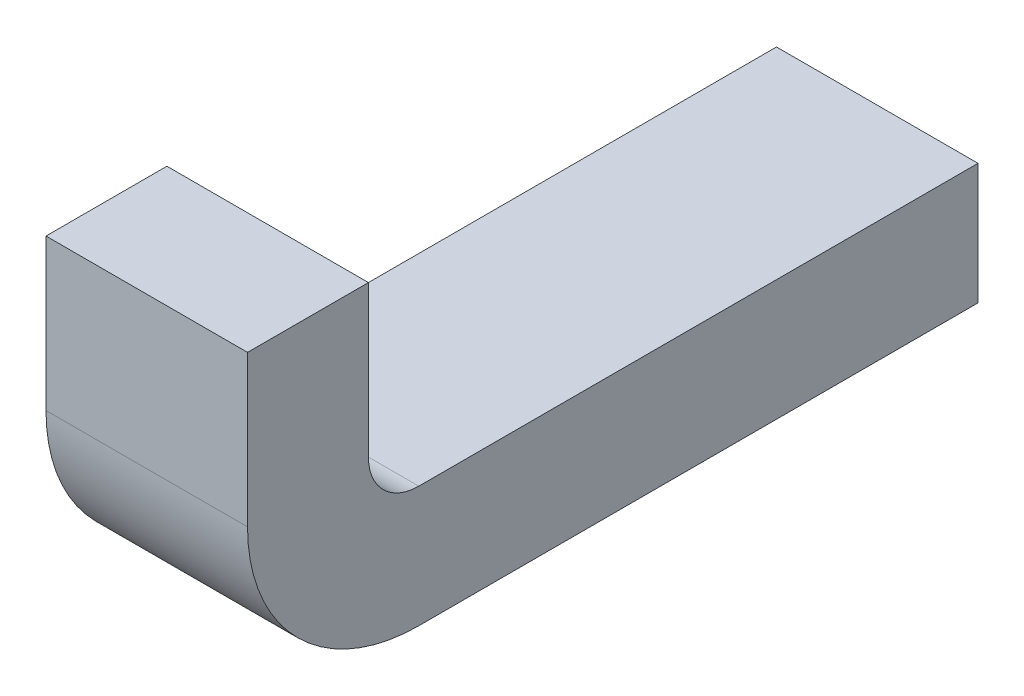
ISO-10303-21;
HEADER;
FILE_DESCRIPTION(('STEP AP214'),'2;1');
FILE_NAME('part.step','',(''),(''),'','','');
FILE_SCHEMA(('AUTOMOTIVE_DESIGN { 1 0 10303 214 1 1 1 1 }'));
ENDSEC;
DATA;
#1=APPLICATION_CONTEXT('core data for automotive mechanical design processes');
#2=APPLICATION_PROTOCOL_DEFINITION('international standard','automotive_design',2000,#1);
#3=PRODUCT_CONTEXT('',#1,'mechanical');
#4=PRODUCT('Part','Part','',(#3));
#5=PRODUCT_RELATED_PRODUCT_CATEGORY('part','',(#4));
#6=PRODUCT_DEFINITION_FORMATION('','',#4);
#7=PRODUCT_DEFINITION_CONTEXT('part definition',#1,'design');
#8=PRODUCT_DEFINITION('design','',#6,#7);
#9=PRODUCT_DEFINITION_SHAPE('','',#8);
#10=(LENGTH_UNIT() NAMED_UNIT(*) SI_UNIT(.MILLI.,.METRE.));
#11=(NAMED_UNIT(*) PLANE_ANGLE_UNIT() SI_UNIT($,.RADIAN.));
#12=(NAMED_UNIT(*) SI_UNIT($,.STERADIAN.) SOLID_ANGLE_UNIT());
#13=UNCERTAINTY_MEASURE_WITH_UNIT(LENGTH_MEASURE(1.E-05),#10,'distance_accuracy_value','');
#14=(GEOMETRIC_REPRESENTATION_CONTEXT(3) GLOBAL_UNCERTAINTY_ASSIGNED_CONTEXT((#13)) GLOBAL_UNIT_ASSIGNED_CONTEXT((#10,
#11,#12)) REPRESENTATION_CONTEXT('',''));
#15=CARTESIAN_POINT('',(0.,0.,0.));
#16=DIRECTION('',(0.,0.,1.));
#17=DIRECTION('',(1.,0.,0.));
#18=AXIS2_PLACEMENT_3D('',#15,#16,#17);
#19=CARTESIAN_POINT('',(2.15,0.32,-3.130000000002));
#20=DIRECTION('',(0.,0.,1.));
#21=DIRECTION('',(1.,0.,0.));
#22=AXIS2_PLACEMENT_3D('',#19,#20,#21);
#23=PLANE('',#22);
#24=DIRECTION('',(0.,1.,0.));
#25=VECTOR('',#24,1.);
#26=CARTESIAN_POINT('',(2.175,0.17,-3.130000000002));
#27=LINE('',#26,#25);
#28=CARTESIAN_POINT('',(2.175,0.17,-3.130000000002));
#29=VERTEX_POINT('',#28);
#30=CARTESIAN_POINT('',(2.175,0.319999999999995,-3.130000000002));
#31=VERTEX_POINT('',#30);
#32=EDGE_CURVE('E123',#29,#31,#27,.T.);
#33=ORIENTED_EDGE('',*,*,#32,.F.);
#34=DIRECTION('',(1.,0.,0.));
#35=VECTOR('',#34,1.);
#36=CARTESIAN_POINT('',(2.15,0.17,-3.130000000002));
#37=LINE('',#36,#35);
#38=CARTESIAN_POINT('',(2.375,0.17,-3.130000000002));
#39=VERTEX_POINT('',#38);
#40=EDGE_CURVE('E64',#39,#29,#37,.F.);
#41=ORIENTED_EDGE('',*,*,#40,.F.);
#42=DIRECTION('',(0.,1.,0.));
#43=VECTOR('',#42,1.);
#44=CARTESIAN_POINT('',(2.375,0.32,-3.130000000002));
#45=LINE('',#44,#43);
#46=CARTESIAN_POINT('',(2.375,0.319999999999995,-3.130000000002));
#47=VERTEX_POINT('',#46);
#48=EDGE_CURVE('E70',#39,#47,#45,.T.);
#49=ORIENTED_EDGE('',*,*,#48,.T.);
#50=DIRECTION('',(1.,0.,0.));
#51=VECTOR('',#50,1.);
#52=CARTESIAN_POINT('',(2.15,0.319999999999985,-3.130000000002));
#53=LINE('',#52,#51);
#54=EDGE_CURVE('E160',#31,#47,#53,.T.);
#55=ORIENTED_EDGE('',*,*,#54,.F.);
#56=EDGE_LOOP('',(#33,#41,#49,#55));
#57=FACE_BOUND('',#56,.T.);
#58=ADVANCED_FACE('F16',(#57),#23,.T.);
#59=CARTESIAN_POINT('',(2.15,0.32,-3.250000000002));
#60=DIRECTION('',(0.,1.,1.246832498358E-13));
#61=DIRECTION('',(0.,-1.246832498358E-13,1.));
#62=AXIS2_PLACEMENT_3D('',#59,#60,#61);
#63=PLANE('',#62);
#64=DIRECTION('',(0.,0.,1.));
#65=VECTOR('',#64,1.);
#66=CARTESIAN_POINT('',(2.175,0.32,-3.300000000002));
#67=LINE('',#66,#65);
#68=CARTESIAN_POINT('',(2.175,0.32,-3.250000000002));
#69=VERTEX_POINT('',#68);
#70=EDGE_CURVE('E101',#31,#69,#67,.F.);
#71=ORIENTED_EDGE('',*,*,#70,.F.);
#72=ORIENTED_EDGE('',*,*,#54,.T.);
#73=DIRECTION('',(0.,0.,1.));
#74=VECTOR('',#73,1.);
#75=CARTESIAN_POINT('',(2.375,0.32,3.855));
#76=LINE('',#75,#74);
#77=CARTESIAN_POINT('',(2.375,0.32,-3.250000000002));
#78=VERTEX_POINT('',#77);
#79=EDGE_CURVE('E148',#47,#78,#76,.F.);
#80=ORIENTED_EDGE('',*,*,#79,.T.);
#81=DIRECTION('',(-1.,0.,0.));
#82=VECTOR('',#81,1.);
#83=CARTESIAN_POINT('',(2.15,0.32,-3.250000000002));
#84=LINE('',#83,#82);
#85=EDGE_CURVE('E155',#69,#78,#84,.F.);
#86=ORIENTED_EDGE('',*,*,#85,.F.);
#87=EDGE_LOOP('',(#71,#72,#80,#86));
#88=FACE_BOUND('',#87,.T.);
#89=ADVANCED_FACE('F179',(#88),#63,.T.);
#90=CARTESIAN_POINT('',(2.15,0.,-3.300000000002));
#91=DIRECTION('',(0.,-1.,0.));
#92=DIRECTION('',(0.,0.,-1.));
#93=AXIS2_PLACEMENT_3D('',#90,#91,#92);
#94=PLANE('',#93);
#95=DIRECTION('',(0.,0.,1.));
#96=VECTOR('',#95,1.);
#97=CARTESIAN_POINT('',(2.175,0.,-3.300000000002));
#98=LINE('',#97,#96);
#99=CARTESIAN_POINT('',(2.175,0.,-3.854999999999));
#100=VERTEX_POINT('',#99);
#101=CARTESIAN_POINT('',(2.175,0.,-3.300000000002));
#102=VERTEX_POINT('',#101);
#103=EDGE_CURVE('E112',#100,#102,#98,.T.);
#104=ORIENTED_EDGE('',*,*,#103,.F.);
#105=DIRECTION('',(-1.,0.,0.));
#106=VECTOR('',#105,1.);
#107=CARTESIAN_POINT('',(2.15,0.,-3.854999999999));
#108=LINE('',#107,#106);
#109=CARTESIAN_POINT('',(2.375,0.,-3.854999999999));
#110=VERTEX_POINT('',#109);
#111=EDGE_CURVE('E125',#110,#100,#108,.T.);
#112=ORIENTED_EDGE('',*,*,#111,.F.);
#113=DIRECTION('',(0.,0.,1.));
#114=VECTOR('',#113,1.);
#115=CARTESIAN_POINT('',(2.375,0.,3.855));
#116=LINE('',#115,#114);
#117=CARTESIAN_POINT('',(2.375,0.,-3.300000000002));
#118=VERTEX_POINT('',#117);
#119=EDGE_CURVE('E57',#110,#118,#116,.T.);
#120=ORIENTED_EDGE('',*,*,#119,.T.);
#121=DIRECTION('',(1.,0.,0.));
#122=VECTOR('',#121,1.);
#123=CARTESIAN_POINT('',(2.15,0.,-3.300000000002));
#124=LINE('',#123,#122);
#125=EDGE_CURVE('E159',#102,#118,#124,.T.);
#126=ORIENTED_EDGE('',*,*,#125,.F.);
#127=EDGE_LOOP('',(#104,#112,#120,#126));
#128=FACE_BOUND('',#127,.T.);
#129=ADVANCED_FACE('F189',(#128),#94,.T.);
#130=CARTESIAN_POINT('',(2.15,0.17,-3.300000000002));
#131=DIRECTION('',(1.,0.,0.));
#132=DIRECTION('',(0.,0.,-1.));
#133=AXIS2_PLACEMENT_3D('',#130,#131,#132);
#134=CYLINDRICAL_SURFACE('',#133,0.17);
#135=CARTESIAN_POINT('',(2.175,0.17,-3.300000000002));
#136=DIRECTION('',(1.,0.,0.));
#137=DIRECTION('',(0.,0.,-1.));
#138=AXIS2_PLACEMENT_3D('',#135,#136,#137);
#139=CIRCLE('',#138,0.17);
#140=EDGE_CURVE('E95',#102,#29,#139,.F.);
#141=ORIENTED_EDGE('',*,*,#140,.F.);
#142=ORIENTED_EDGE('',*,*,#125,.T.);
#143=CARTESIAN_POINT('',(2.375,0.17,-3.300000000002));
#144=DIRECTION('',(1.,0.,0.));
#145=DIRECTION('',(0.,0.,-1.));
#146=AXIS2_PLACEMENT_3D('',#143,#144,#145);
#147=CIRCLE('',#146,0.17);
#148=EDGE_CURVE('E19',#118,#39,#147,.F.);
#149=ORIENTED_EDGE('',*,*,#148,.T.);
#150=ORIENTED_EDGE('',*,*,#40,.T.);
#151=EDGE_LOOP('',(#141,#142,#149,#150));
#152=FACE_BOUND('',#151,.T.);
#153=ADVANCED_FACE('F192',(#152),#134,.T.);
#154=CARTESIAN_POINT('',(2.15,0.17,-3.250000000002));
#155=DIRECTION('',(0.,0.,-1.));
#156=DIRECTION('',(-1.,0.,0.));
#157=AXIS2_PLACEMENT_3D('',#154,#155,#156);
#158=PLANE('',#157);
#159=DIRECTION('',(0.,1.,0.));
#160=VECTOR('',#159,1.);
#161=CARTESIAN_POINT('',(2.175,0.17,-3.250000000002));
#162=LINE('',#161,#160);
#163=CARTESIAN_POINT('',(2.175,0.17,-3.250000000002));
#164=VERTEX_POINT('',#163);
#165=EDGE_CURVE('E91',#69,#164,#162,.F.);
#166=ORIENTED_EDGE('',*,*,#165,.F.);
#167=ORIENTED_EDGE('',*,*,#85,.T.);
#168=DIRECTION('',(0.,1.,0.));
#169=VECTOR('',#168,1.);
#170=CARTESIAN_POINT('',(2.375,0.32,-3.250000000002));
#171=LINE('',#170,#169);
#172=CARTESIAN_POINT('',(2.375,0.17,-3.250000000002));
#173=VERTEX_POINT('',#172);
#174=EDGE_CURVE('E85',#78,#173,#171,.F.);
#175=ORIENTED_EDGE('',*,*,#174,.T.);
#176=DIRECTION('',(1.,0.,0.));
#177=VECTOR('',#176,1.);
#178=CARTESIAN_POINT('',(2.15,0.17,-3.250000000002));
#179=LINE('',#178,#177);
#180=EDGE_CURVE('E89',#173,#164,#179,.F.);
#181=ORIENTED_EDGE('',*,*,#180,.T.);
#182=EDGE_LOOP('',(#166,#167,#175,#181));
#183=FACE_BOUND('',#182,.T.);
#184=ADVANCED_FACE('F90',(#183),#158,.T.);
#185=CARTESIAN_POINT('',(2.375,0.32,3.855));
#186=DIRECTION('',(-1.,0.,0.));
#187=DIRECTION('',(0.,0.,1.));
#188=AXIS2_PLACEMENT_3D('',#185,#186,#187);
#189=PLANE('',#188);
#190=ORIENTED_EDGE('',*,*,#79,.F.);
#191=ORIENTED_EDGE('',*,*,#48,.F.);
#192=ORIENTED_EDGE('',*,*,#148,.F.);
#193=ORIENTED_EDGE('',*,*,#119,.F.);
#194=DIRECTION('',(0.,1.,0.));
#195=VECTOR('',#194,1.);
#196=CARTESIAN_POINT('',(2.375,0.,-3.854999999999));
#197=LINE('',#196,#195);
#198=CARTESIAN_POINT('',(2.375,0.12,-3.854999999999));
#199=VERTEX_POINT('',#198);
#200=EDGE_CURVE('E138',#199,#110,#197,.F.);
#201=ORIENTED_EDGE('',*,*,#200,.F.);
#202=DIRECTION('',(0.,0.,1.));
#203=VECTOR('',#202,1.);
#204=CARTESIAN_POINT('',(2.375,0.12,-3.854999999999));
#205=LINE('',#204,#203);
#206=CARTESIAN_POINT('',(2.375,0.12,-3.300000000002));
#207=VERTEX_POINT('',#206);
#208=EDGE_CURVE('E108',#207,#199,#205,.F.);
#209=ORIENTED_EDGE('',*,*,#208,.F.);
#210=CARTESIAN_POINT('',(2.375,0.17,-3.300000000002));
#211=DIRECTION('',(1.,0.,0.));
#212=DIRECTION('',(0.,0.,-1.));
#213=AXIS2_PLACEMENT_3D('',#210,#211,#212);
#214=CIRCLE('',#213,0.05);
#215=EDGE_CURVE('E106',#207,#173,#214,.F.);
#216=ORIENTED_EDGE('',*,*,#215,.T.);
#217=ORIENTED_EDGE('',*,*,#174,.F.);
#218=EDGE_LOOP('',(#190,#191,#192,#193,#201,#209,#216,#217));
#219=FACE_BOUND('',#218,.T.);
#220=ADVANCED_FACE('F181',(#219),#189,.F.);
#221=CARTESIAN_POINT('',(2.15,0.,-3.854999999999));
#222=DIRECTION('',(0.,0.,-1.));
#223=DIRECTION('',(-1.,0.,0.));
#224=AXIS2_PLACEMENT_3D('',#221,#222,#223);
#225=PLANE('',#224);
#226=DIRECTION('',(0.,1.,0.));
#227=VECTOR('',#226,1.);
#228=CARTESIAN_POINT('',(2.175,0.17,-3.854999999999));
#229=LINE('',#228,#227);
#230=CARTESIAN_POINT('',(2.175,0.12,-3.854999999999));
#231=VERTEX_POINT('',#230);
#232=EDGE_CURVE('E102',#231,#100,#229,.F.);
#233=ORIENTED_EDGE('',*,*,#232,.F.);
#234=DIRECTION('',(1.,0.,0.));
#235=VECTOR('',#234,1.);
#236=CARTESIAN_POINT('',(2.15,0.12,-3.854999999999));
#237=LINE('',#236,#235);
#238=EDGE_CURVE('E129',#199,#231,#237,.F.);
#239=ORIENTED_EDGE('',*,*,#238,.F.);
#240=ORIENTED_EDGE('',*,*,#200,.T.);
#241=ORIENTED_EDGE('',*,*,#111,.T.);
#242=EDGE_LOOP('',(#233,#239,#240,#241));
#243=FACE_BOUND('',#242,.T.);
#244=ADVANCED_FACE('F188',(#243),#225,.T.);
#245=CARTESIAN_POINT('',(2.175,0.17,-3.300000000002));
#246=DIRECTION('',(-1.,0.,0.));
#247=DIRECTION('',(0.,0.,1.));
#248=AXIS2_PLACEMENT_3D('',#245,#246,#247);
#249=PLANE('',#248);
#250=ORIENTED_EDGE('',*,*,#103,.T.);
#251=ORIENTED_EDGE('',*,*,#140,.T.);
#252=ORIENTED_EDGE('',*,*,#32,.T.);
#253=ORIENTED_EDGE('',*,*,#70,.T.);
#254=ORIENTED_EDGE('',*,*,#165,.T.);
#255=CARTESIAN_POINT('',(2.175,0.17,-3.300000000002));
#256=DIRECTION('',(1.,0.,0.));
#257=DIRECTION('',(0.,0.,-1.));
#258=AXIS2_PLACEMENT_3D('',#255,#256,#257);
#259=CIRCLE('',#258,0.05);
#260=CARTESIAN_POINT('',(2.175,0.12,-3.300000000002));
#261=VERTEX_POINT('',#260);
#262=EDGE_CURVE('E34',#164,#261,#259,.T.);
#263=ORIENTED_EDGE('',*,*,#262,.T.);
#264=DIRECTION('',(0.,0.,1.));
#265=VECTOR('',#264,1.);
#266=CARTESIAN_POINT('',(2.175,0.12,-3.854999999999));
#267=LINE('',#266,#265);
#268=EDGE_CURVE('E25',#231,#261,#267,.T.);
#269=ORIENTED_EDGE('',*,*,#268,.F.);
#270=ORIENTED_EDGE('',*,*,#232,.T.);
#271=EDGE_LOOP('',(#250,#251,#252,#253,#254,#263,#269,#270));
#272=FACE_BOUND('',#271,.T.);
#273=ADVANCED_FACE('F98',(#272),#249,.T.);
#274=CARTESIAN_POINT('',(2.15,0.17,-3.300000000002));
#275=DIRECTION('',(1.,0.,0.));
#276=DIRECTION('',(0.,0.,-1.));
#277=AXIS2_PLACEMENT_3D('',#274,#275,#276);
#278=CYLINDRICAL_SURFACE('',#277,0.05);
#279=DIRECTION('',(1.,0.,0.));
#280=VECTOR('',#279,1.);
#281=CARTESIAN_POINT('',(2.15,0.12,-3.300000000002));
#282=LINE('',#281,#280);
#283=EDGE_CURVE('E11',#261,#207,#282,.T.);
#284=ORIENTED_EDGE('',*,*,#283,.F.);
#285=ORIENTED_EDGE('',*,*,#262,.F.);
#286=ORIENTED_EDGE('',*,*,#180,.F.);
#287=ORIENTED_EDGE('',*,*,#215,.F.);
#288=EDGE_LOOP('',(#284,#285,#286,#287));
#289=FACE_BOUND('',#288,.T.);
#290=ADVANCED_FACE('F104',(#289),#278,.F.);
#291=CARTESIAN_POINT('',(2.15,0.12,-3.854999999999));
#292=DIRECTION('',(0.,1.,0.));
#293=DIRECTION('',(0.,0.,1.));
#294=AXIS2_PLACEMENT_3D('',#291,#292,#293);
#295=PLANE('',#294);
#296=ORIENTED_EDGE('',*,*,#268,.T.);
#297=ORIENTED_EDGE('',*,*,#283,.T.);
#298=ORIENTED_EDGE('',*,*,#208,.T.);
#299=ORIENTED_EDGE('',*,*,#238,.T.);
#300=EDGE_LOOP('',(#296,#297,#298,#299));
#301=FACE_BOUND('',#300,.T.);
#302=ADVANCED_FACE('F184',(#301),#295,.T.);
#303=CLOSED_SHELL('',(#58,#89,#129,#153,#184,#220,#244,#273,#290,#302));
#304=MANIFOLD_SOLID_BREP('B1',#303);
#305=ADVANCED_BREP_SHAPE_REPRESENTATION('',(#18,#304),#14);
#306=SHAPE_DEFINITION_REPRESENTATION(#9,#305);
ENDSEC;
END-ISO-10303-21;
